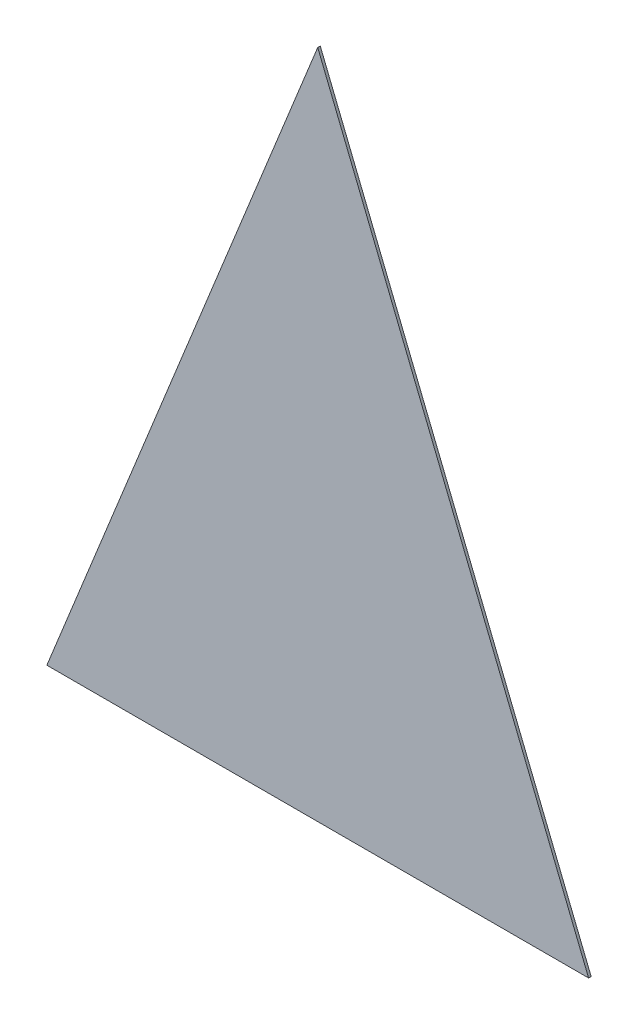
ISO-10303-21;
HEADER;
FILE_DESCRIPTION(('STEP AP214'),'2;1');
FILE_NAME('part.step','',(''),(''),'','','');
FILE_SCHEMA(('AUTOMOTIVE_DESIGN { 1 0 10303 214 1 1 1 1 }'));
ENDSEC;
DATA;
#1=APPLICATION_CONTEXT('core data for automotive mechanical design processes');
#2=APPLICATION_PROTOCOL_DEFINITION('international standard','automotive_design',2000,#1);
#3=PRODUCT_CONTEXT('',#1,'mechanical');
#4=PRODUCT('Part','Part','',(#3));
#5=PRODUCT_RELATED_PRODUCT_CATEGORY('part','',(#4));
#6=PRODUCT_DEFINITION_FORMATION('','',#4);
#7=PRODUCT_DEFINITION_CONTEXT('part definition',#1,'design');
#8=PRODUCT_DEFINITION('design','',#6,#7);
#9=PRODUCT_DEFINITION_SHAPE('','',#8);
#10=(LENGTH_UNIT() NAMED_UNIT(*) SI_UNIT(.MILLI.,.METRE.));
#11=(NAMED_UNIT(*) PLANE_ANGLE_UNIT() SI_UNIT($,.RADIAN.));
#12=(NAMED_UNIT(*) SI_UNIT($,.STERADIAN.) SOLID_ANGLE_UNIT());
#13=UNCERTAINTY_MEASURE_WITH_UNIT(LENGTH_MEASURE(1.E-05),#10,'distance_accuracy_value','');
#14=(GEOMETRIC_REPRESENTATION_CONTEXT(3) GLOBAL_UNCERTAINTY_ASSIGNED_CONTEXT((#13)) GLOBAL_UNIT_ASSIGNED_CONTEXT((#10,
#11,#12)) REPRESENTATION_CONTEXT('',''));
#15=CARTESIAN_POINT('',(0.,0.,0.));
#16=DIRECTION('',(0.,0.,1.));
#17=DIRECTION('',(1.,0.,0.));
#18=AXIS2_PLACEMENT_3D('',#15,#16,#17);
#19=CARTESIAN_POINT('',(0.59948273447205,-0.192580169588,0.0009));
#20=DIRECTION('',(0.,0.,-1.));
#21=DIRECTION('',(-1.,0.,0.));
#22=AXIS2_PLACEMENT_3D('',#19,#20,#21);
#23=PLANE('',#22);
#24=DIRECTION('',(-1.,0.,0.));
#25=VECTOR('',#24,1.);
#26=CARTESIAN_POINT('',(0.6101150617055,-0.192580169588,0.0009));
#27=LINE('',#26,#25);
#28=CARTESIAN_POINT('',(0.6101150617055,-0.192580169588,0.0009));
#29=VERTEX_POINT('',#28);
#30=CARTESIAN_POINT('',(0.5888504072386,-0.192580169588,0.0009));
#31=VERTEX_POINT('',#30);
#32=EDGE_CURVE('E11',#29,#31,#27,.T.);
#33=ORIENTED_EDGE('',*,*,#32,.T.);
#34=DIRECTION('',(0.374606593413568,0.927183854567735,0.));
#35=VECTOR('',#34,1.);
#36=CARTESIAN_POINT('',(0.5888504072386,-0.192580169588,0.0009));
#37=LINE('',#36,#35);
#38=CARTESIAN_POINT('',(0.599482734472,-0.1662642362312,0.0009));
#39=VERTEX_POINT('',#38);
#40=EDGE_CURVE('E24',#31,#39,#37,.T.);
#41=ORIENTED_EDGE('',*,*,#40,.T.);
#42=DIRECTION('',(0.374606593416596,-0.927183854566511,0.));
#43=VECTOR('',#42,1.);
#44=CARTESIAN_POINT('',(0.599482734472,-0.1662642362312,0.0009));
#45=LINE('',#44,#43);
#46=EDGE_CURVE('E62',#39,#29,#45,.T.);
#47=ORIENTED_EDGE('',*,*,#46,.T.);
#48=EDGE_LOOP('',(#33,#41,#47));
#49=FACE_BOUND('',#48,.T.);
#50=ADVANCED_FACE('F17',(#49),#23,.T.);
#51=CARTESIAN_POINT('',(0.59948273447205,-0.192580169588,0.0009));
#52=DIRECTION('',(0.,-1.,0.));
#53=DIRECTION('',(0.,0.,-1.));
#54=AXIS2_PLACEMENT_3D('',#51,#52,#53);
#55=PLANE('',#54);
#56=DIRECTION('',(1.,0.,0.));
#57=VECTOR('',#56,1.);
#58=CARTESIAN_POINT('',(0.5888504072386,-0.192580169588,0.001));
#59=LINE('',#58,#57);
#60=CARTESIAN_POINT('',(0.5888504072386,-0.192580169588,0.001));
#61=VERTEX_POINT('',#60);
#62=CARTESIAN_POINT('',(0.6101150617055,-0.192580169588,0.001));
#63=VERTEX_POINT('',#62);
#64=EDGE_CURVE('E53',#61,#63,#59,.T.);
#65=ORIENTED_EDGE('',*,*,#64,.F.);
#66=DIRECTION('',(0.,0.,-1.));
#67=VECTOR('',#66,1.);
#68=CARTESIAN_POINT('',(0.5888504072386,-0.192580169588,0.001));
#69=LINE('',#68,#67);
#70=EDGE_CURVE('E67',#61,#31,#69,.T.);
#71=ORIENTED_EDGE('',*,*,#70,.T.);
#72=ORIENTED_EDGE('',*,*,#32,.F.);
#73=DIRECTION('',(0.,0.,-1.));
#74=VECTOR('',#73,1.);
#75=CARTESIAN_POINT('',(0.6101150617055,-0.192580169588,0.001));
#76=LINE('',#75,#74);
#77=EDGE_CURVE('E56',#63,#29,#76,.T.);
#78=ORIENTED_EDGE('',*,*,#77,.F.);
#79=EDGE_LOOP('',(#65,#71,#72,#78));
#80=FACE_BOUND('',#79,.T.);
#81=ADVANCED_FACE('F73',(#80),#55,.T.);
#82=CARTESIAN_POINT('',(0.60479889808875,-0.1794222029096,0.0009));
#83=DIRECTION('',(0.927183854566511,0.374606593416596,0.));
#84=DIRECTION('',(0.,0.,-1.));
#85=AXIS2_PLACEMENT_3D('',#82,#83,#84);
#86=PLANE('',#85);
#87=DIRECTION('',(-0.374606593416596,0.927183854566511,0.));
#88=VECTOR('',#87,1.);
#89=CARTESIAN_POINT('',(0.6101150617055,-0.192580169588,0.001));
#90=LINE('',#89,#88);
#91=CARTESIAN_POINT('',(0.599482734472,-0.1662642362312,0.001));
#92=VERTEX_POINT('',#91);
#93=EDGE_CURVE('E48',#63,#92,#90,.T.);
#94=ORIENTED_EDGE('',*,*,#93,.F.);
#95=ORIENTED_EDGE('',*,*,#77,.T.);
#96=ORIENTED_EDGE('',*,*,#46,.F.);
#97=DIRECTION('',(0.,0.,-1.));
#98=VECTOR('',#97,1.);
#99=CARTESIAN_POINT('',(0.599482734472,-0.1662642362312,0.001));
#100=LINE('',#99,#98);
#101=EDGE_CURVE('E57',#92,#39,#100,.T.);
#102=ORIENTED_EDGE('',*,*,#101,.F.);
#103=EDGE_LOOP('',(#94,#95,#96,#102));
#104=FACE_BOUND('',#103,.T.);
#105=ADVANCED_FACE('F61',(#104),#86,.T.);
#106=CARTESIAN_POINT('',(0.5941665708553,-0.1794222029096,0.0009));
#107=DIRECTION('',(-0.927183854567735,0.374606593413568,0.));
#108=DIRECTION('',(0.,0.,1.));
#109=AXIS2_PLACEMENT_3D('',#106,#107,#108);
#110=PLANE('',#109);
#111=DIRECTION('',(-0.374606593413568,-0.927183854567735,0.));
#112=VECTOR('',#111,1.);
#113=CARTESIAN_POINT('',(0.599482734472,-0.1662642362312,0.001));
#114=LINE('',#113,#112);
#115=EDGE_CURVE('E52',#92,#61,#114,.T.);
#116=ORIENTED_EDGE('',*,*,#115,.F.);
#117=ORIENTED_EDGE('',*,*,#101,.T.);
#118=ORIENTED_EDGE('',*,*,#40,.F.);
#119=ORIENTED_EDGE('',*,*,#70,.F.);
#120=EDGE_LOOP('',(#116,#117,#118,#119));
#121=FACE_BOUND('',#120,.T.);
#122=ADVANCED_FACE('F66',(#121),#110,.T.);
#123=CARTESIAN_POINT('',(0.59948273447205,-0.192580169588,0.001));
#124=DIRECTION('',(0.,0.,-1.));
#125=DIRECTION('',(-1.,0.,0.));
#126=AXIS2_PLACEMENT_3D('',#123,#124,#125);
#127=PLANE('',#126);
#128=ORIENTED_EDGE('',*,*,#93,.T.);
#129=ORIENTED_EDGE('',*,*,#115,.T.);
#130=ORIENTED_EDGE('',*,*,#64,.T.);
#131=EDGE_LOOP('',(#128,#129,#130));
#132=FACE_BOUND('',#131,.T.);
#133=ADVANCED_FACE('F50',(#132),#127,.F.);
#134=CLOSED_SHELL('',(#50,#81,#105,#122,#133));
#135=MANIFOLD_SOLID_BREP('B1',#134);
#136=ADVANCED_BREP_SHAPE_REPRESENTATION('',(#18,#135),#14);
#137=SHAPE_DEFINITION_REPRESENTATION(#9,#136);
ENDSEC;
END-ISO-10303-21;
